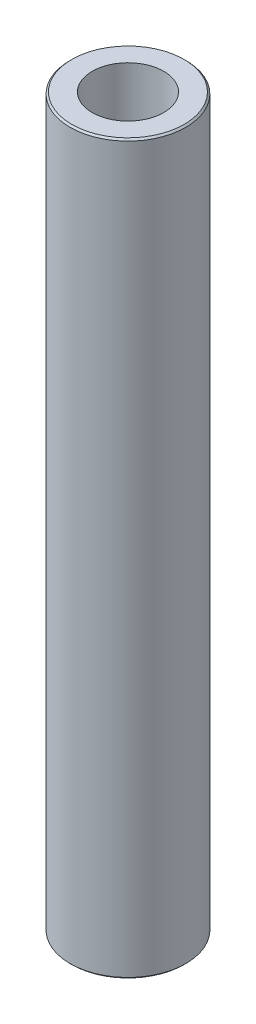
ISO-10303-21;
HEADER;
FILE_DESCRIPTION(('STEP AP214'),'2;1');
FILE_NAME('part.step','',(''),(''),'','','');
FILE_SCHEMA(('AUTOMOTIVE_DESIGN { 1 0 10303 214 1 1 1 1 }'));
ENDSEC;
DATA;
#1=APPLICATION_CONTEXT('core data for automotive mechanical design processes');
#2=APPLICATION_PROTOCOL_DEFINITION('international standard','automotive_design',2000,#1);
#3=PRODUCT_CONTEXT('',#1,'mechanical');
#4=PRODUCT('Part','Part','',(#3));
#5=PRODUCT_RELATED_PRODUCT_CATEGORY('part','',(#4));
#6=PRODUCT_DEFINITION_FORMATION('','',#4);
#7=PRODUCT_DEFINITION_CONTEXT('part definition',#1,'design');
#8=PRODUCT_DEFINITION('design','',#6,#7);
#9=PRODUCT_DEFINITION_SHAPE('','',#8);
#10=(LENGTH_UNIT() NAMED_UNIT(*) SI_UNIT(.MILLI.,.METRE.));
#11=(NAMED_UNIT(*) PLANE_ANGLE_UNIT() SI_UNIT($,.RADIAN.));
#12=(NAMED_UNIT(*) SI_UNIT($,.STERADIAN.) SOLID_ANGLE_UNIT());
#13=UNCERTAINTY_MEASURE_WITH_UNIT(LENGTH_MEASURE(1.E-05),#10,'distance_accuracy_value','');
#14=(GEOMETRIC_REPRESENTATION_CONTEXT(3) GLOBAL_UNCERTAINTY_ASSIGNED_CONTEXT((#13)) GLOBAL_UNIT_ASSIGNED_CONTEXT((#10,
#11,#12)) REPRESENTATION_CONTEXT('',''));
#15=CARTESIAN_POINT('',(0.,0.,0.));
#16=DIRECTION('',(0.,0.,1.));
#17=DIRECTION('',(1.,0.,0.));
#18=AXIS2_PLACEMENT_3D('',#15,#16,#17);
#19=CARTESIAN_POINT('',(0.,94.2039913939182,0.));
#20=DIRECTION('',(0.,-1.,0.));
#21=DIRECTION('',(0.,0.,-1.));
#22=AXIS2_PLACEMENT_3D('',#19,#20,#21);
#23=CYLINDRICAL_SURFACE('',#22,7.5);
#24=CARTESIAN_POINT('',(0.,93.9867379536708,0.));
#25=DIRECTION('',(0.,1.,0.));
#26=DIRECTION('',(0.,0.,1.));
#27=AXIS2_PLACEMENT_3D('',#24,#25,#26);
#28=CIRCLE('',#27,7.5);
#29=CARTESIAN_POINT('',(0.,93.9867379536708,7.5));
#30=VERTEX_POINT('',#29);
#31=EDGE_CURVE('E50',#30,#30,#28,.F.);
#32=ORIENTED_EDGE('',*,*,#31,.T.);
#33=EDGE_LOOP('',(#32));
#34=FACE_BOUND('',#33,.T.);
#35=CARTESIAN_POINT('',(0.,0.217253440247395,0.));
#36=DIRECTION('',(0.,1.,0.));
#37=DIRECTION('',(0.,0.,1.));
#38=AXIS2_PLACEMENT_3D('',#35,#36,#37);
#39=CIRCLE('',#38,7.5);
#40=CARTESIAN_POINT('',(0.,0.217253440247395,7.5));
#41=VERTEX_POINT('',#40);
#42=EDGE_CURVE('E51',#41,#41,#39,.T.);
#43=ORIENTED_EDGE('',*,*,#42,.T.);
#44=EDGE_LOOP('',(#43));
#45=FACE_BOUND('',#44,.T.);
#46=ADVANCED_FACE('F39',(#34,#45),#23,.T.);
#47=CARTESIAN_POINT('',(0.,94.2039913939182,0.));
#48=DIRECTION('',(0.,1.,0.));
#49=DIRECTION('',(0.,0.,1.));
#50=AXIS2_PLACEMENT_3D('',#47,#48,#49);
#51=PLANE('',#50);
#52=CARTESIAN_POINT('',(0.,94.2039913939182,0.));
#53=DIRECTION('',(0.,1.,0.));
#54=DIRECTION('',(0.,0.,1.));
#55=AXIS2_PLACEMENT_3D('',#52,#53,#54);
#56=CIRCLE('',#55,7.2827465597526);
#57=CARTESIAN_POINT('',(0.,94.2039913939182,7.2827465597526));
#58=VERTEX_POINT('',#57);
#59=EDGE_CURVE('E54',#58,#58,#56,.T.);
#60=ORIENTED_EDGE('',*,*,#59,.T.);
#61=EDGE_LOOP('',(#60));
#62=FACE_BOUND('',#61,.T.);
#63=CARTESIAN_POINT('',(0.,94.2039913939182,0.));
#64=DIRECTION('',(0.,1.,0.));
#65=DIRECTION('',(0.,0.,1.));
#66=AXIS2_PLACEMENT_3D('',#63,#64,#65);
#67=CIRCLE('',#66,4.63183139960246);
#68=CARTESIAN_POINT('',(0.,94.2039913939182,4.63183139960246));
#69=VERTEX_POINT('',#68);
#70=EDGE_CURVE('E58',#69,#69,#67,.T.);
#71=ORIENTED_EDGE('',*,*,#70,.F.);
#72=EDGE_LOOP('',(#71));
#73=FACE_BOUND('',#72,.T.);
#74=ADVANCED_FACE('F69',(#62,#73),#51,.T.);
#75=CARTESIAN_POINT('',(0.,0.,0.));
#76=DIRECTION('',(0.,1.,0.));
#77=DIRECTION('',(0.,0.,1.));
#78=AXIS2_PLACEMENT_3D('',#75,#76,#77);
#79=PLANE('',#78);
#80=CARTESIAN_POINT('',(0.,0.,0.));
#81=DIRECTION('',(0.,1.,0.));
#82=DIRECTION('',(0.,0.,1.));
#83=AXIS2_PLACEMENT_3D('',#80,#81,#82);
#84=CIRCLE('',#83,7.28274655975261);
#85=CARTESIAN_POINT('',(0.,0.,7.28274655975261));
#86=VERTEX_POINT('',#85);
#87=EDGE_CURVE('E10',#86,#86,#84,.F.);
#88=ORIENTED_EDGE('',*,*,#87,.T.);
#89=EDGE_LOOP('',(#88));
#90=FACE_BOUND('',#89,.T.);
#91=CARTESIAN_POINT('',(0.,0.,0.));
#92=DIRECTION('',(0.,1.,0.));
#93=DIRECTION('',(0.,0.,1.));
#94=AXIS2_PLACEMENT_3D('',#91,#92,#93);
#95=CIRCLE('',#94,4.63183139960246);
#96=CARTESIAN_POINT('',(0.,0.,4.63183139960246));
#97=VERTEX_POINT('',#96);
#98=EDGE_CURVE('E63',#97,#97,#95,.T.);
#99=ORIENTED_EDGE('',*,*,#98,.T.);
#100=EDGE_LOOP('',(#99));
#101=FACE_BOUND('',#100,.T.);
#102=ADVANCED_FACE('F75',(#90,#101),#79,.F.);
#103=CARTESIAN_POINT('',(0.,94.2039913939182,0.));
#104=DIRECTION('',(0.,-1.,0.));
#105=DIRECTION('',(0.,0.,-1.));
#106=AXIS2_PLACEMENT_3D('',#103,#104,#105);
#107=CYLINDRICAL_SURFACE('',#106,4.63183139960246);
#108=ORIENTED_EDGE('',*,*,#70,.T.);
#109=EDGE_LOOP('',(#108));
#110=FACE_BOUND('',#109,.T.);
#111=ORIENTED_EDGE('',*,*,#98,.F.);
#112=EDGE_LOOP('',(#111));
#113=FACE_BOUND('',#112,.T.);
#114=ADVANCED_FACE('F70',(#110,#113),#107,.F.);
#115=CARTESIAN_POINT('',(0.,94.2039913939182,0.));
#116=DIRECTION('',(0.,-1.,0.));
#117=DIRECTION('',(0.,0.,-1.));
#118=AXIS2_PLACEMENT_3D('',#115,#116,#117);
#119=CONICAL_SURFACE('',#118,7.2827465597526,0.785398163397432);
#120=ORIENTED_EDGE('',*,*,#31,.F.);
#121=EDGE_LOOP('',(#120));
#122=FACE_BOUND('',#121,.T.);
#123=ORIENTED_EDGE('',*,*,#59,.F.);
#124=EDGE_LOOP('',(#123));
#125=FACE_BOUND('',#124,.T.);
#126=ADVANCED_FACE('F81',(#122,#125),#119,.T.);
#127=CARTESIAN_POINT('',(0.,0.217253440247395,0.));
#128=DIRECTION('',(0.,1.,0.));
#129=DIRECTION('',(0.,0.,1.));
#130=AXIS2_PLACEMENT_3D('',#127,#128,#129);
#131=CONICAL_SURFACE('',#130,7.5,0.785398163397432);
#132=ORIENTED_EDGE('',*,*,#87,.F.);
#133=EDGE_LOOP('',(#132));
#134=FACE_BOUND('',#133,.T.);
#135=ORIENTED_EDGE('',*,*,#42,.F.);
#136=EDGE_LOOP('',(#135));
#137=FACE_BOUND('',#136,.T.);
#138=ADVANCED_FACE('F45',(#134,#137),#131,.T.);
#139=CLOSED_SHELL('',(#46,#74,#102,#114,#126,#138));
#140=MANIFOLD_SOLID_BREP('B2',#139);
#141=ADVANCED_BREP_SHAPE_REPRESENTATION('',(#18,#140),#14);
#142=SHAPE_DEFINITION_REPRESENTATION(#9,#141);
ENDSEC;
END-ISO-10303-21;
